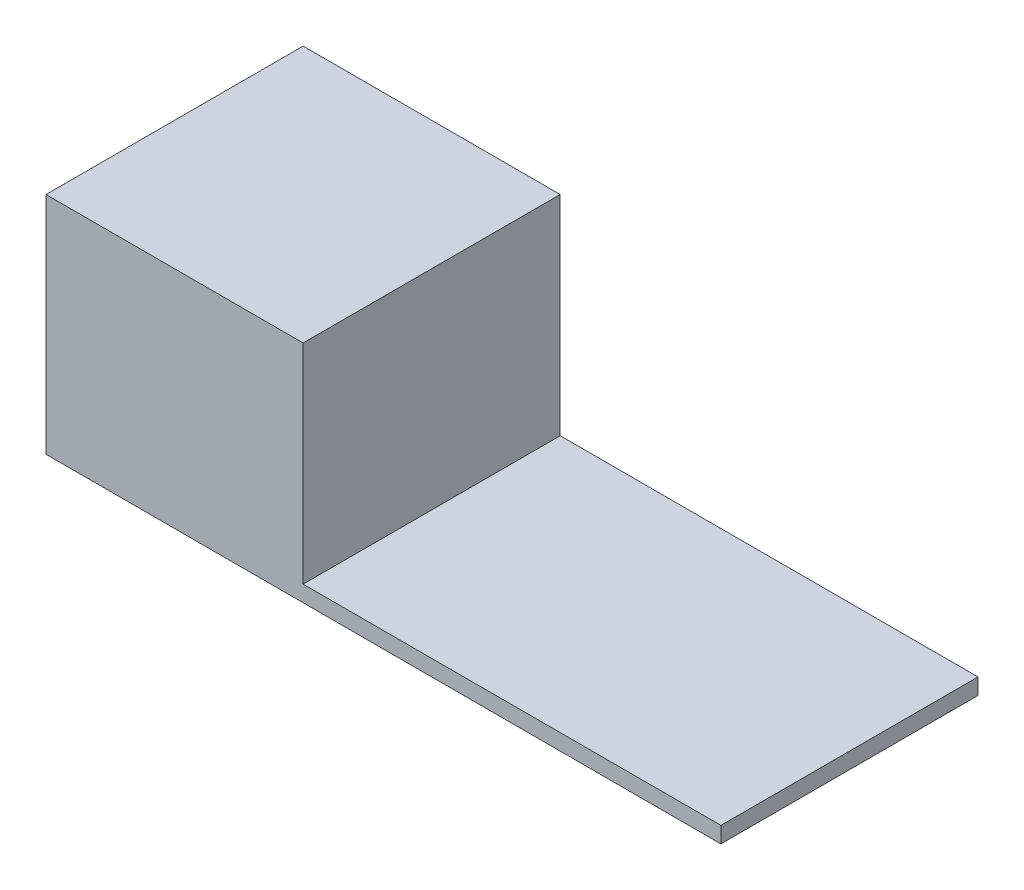
ISO-10303-21;
HEADER;
FILE_DESCRIPTION(('STEP AP214'),'2;1');
FILE_NAME('part.step','',(''),(''),'','','');
FILE_SCHEMA(('AUTOMOTIVE_DESIGN { 1 0 10303 214 1 1 1 1 }'));
ENDSEC;
DATA;
#1=APPLICATION_CONTEXT('core data for automotive mechanical design processes');
#2=APPLICATION_PROTOCOL_DEFINITION('international standard','automotive_design',2000,#1);
#3=PRODUCT_CONTEXT('',#1,'mechanical');
#4=PRODUCT('Part','Part','',(#3));
#5=PRODUCT_RELATED_PRODUCT_CATEGORY('part','',(#4));
#6=PRODUCT_DEFINITION_FORMATION('','',#4);
#7=PRODUCT_DEFINITION_CONTEXT('part definition',#1,'design');
#8=PRODUCT_DEFINITION('design','',#6,#7);
#9=PRODUCT_DEFINITION_SHAPE('','',#8);
#10=(LENGTH_UNIT() NAMED_UNIT(*) SI_UNIT(.MILLI.,.METRE.));
#11=(NAMED_UNIT(*) PLANE_ANGLE_UNIT() SI_UNIT($,.RADIAN.));
#12=(NAMED_UNIT(*) SI_UNIT($,.STERADIAN.) SOLID_ANGLE_UNIT());
#13=UNCERTAINTY_MEASURE_WITH_UNIT(LENGTH_MEASURE(1.E-05),#10,'distance_accuracy_value','');
#14=(GEOMETRIC_REPRESENTATION_CONTEXT(3) GLOBAL_UNCERTAINTY_ASSIGNED_CONTEXT((#13)) GLOBAL_UNIT_ASSIGNED_CONTEXT((#10,
#11,#12)) REPRESENTATION_CONTEXT('',''));
#15=CARTESIAN_POINT('',(0.,0.,0.));
#16=DIRECTION('',(0.,0.,1.));
#17=DIRECTION('',(1.,0.,0.));
#18=AXIS2_PLACEMENT_3D('',#15,#16,#17);
#19=CARTESIAN_POINT('',(0.,0.5,0.));
#20=DIRECTION('',(0.,-1.,0.));
#21=DIRECTION('',(0.,0.,-1.));
#22=AXIS2_PLACEMENT_3D('',#19,#20,#21);
#23=PLANE('',#22);
#24=DIRECTION('',(0.,0.,-1.));
#25=VECTOR('',#24,1.);
#26=CARTESIAN_POINT('',(-9.91329346728701,0.5,5.85626901815152));
#27=LINE('',#26,#25);
#28=CARTESIAN_POINT('',(-9.91329346728701,0.5,5.85626901815152));
#29=VERTEX_POINT('',#28);
#30=CARTESIAN_POINT('',(-9.91329346728701,0.5,-2.14373098184848));
#31=VERTEX_POINT('',#30);
#32=EDGE_CURVE('E49',#29,#31,#27,.T.);
#33=ORIENTED_EDGE('',*,*,#32,.F.);
#34=DIRECTION('',(1.,0.,0.));
#35=VECTOR('',#34,1.);
#36=CARTESIAN_POINT('',(-17.913293467287,0.5,5.85626901815152));
#37=LINE('',#36,#35);
#38=CARTESIAN_POINT('',(3.08670653271299,0.5,5.85626901815152));
#39=VERTEX_POINT('',#38);
#40=EDGE_CURVE('E86',#29,#39,#37,.T.);
#41=ORIENTED_EDGE('',*,*,#40,.T.);
#42=DIRECTION('',(0.,0.,-1.));
#43=VECTOR('',#42,1.);
#44=CARTESIAN_POINT('',(3.08670653271299,0.5,5.85626901815152));
#45=LINE('',#44,#43);
#46=CARTESIAN_POINT('',(3.08670653271299,0.5,-2.14373098184848));
#47=VERTEX_POINT('',#46);
#48=EDGE_CURVE('E55',#39,#47,#45,.T.);
#49=ORIENTED_EDGE('',*,*,#48,.T.);
#50=DIRECTION('',(-1.,0.,0.));
#51=VECTOR('',#50,1.);
#52=CARTESIAN_POINT('',(-17.913293467287,0.5,-2.14373098184848));
#53=LINE('',#52,#51);
#54=EDGE_CURVE('E96',#47,#31,#53,.T.);
#55=ORIENTED_EDGE('',*,*,#54,.T.);
#56=EDGE_LOOP('',(#33,#41,#49,#55));
#57=FACE_BOUND('',#56,.T.);
#58=ADVANCED_FACE('F34',(#57),#23,.F.);
#59=CARTESIAN_POINT('',(-17.913293467287,0.5,5.85626901815152));
#60=DIRECTION('',(1.,0.,0.));
#61=DIRECTION('',(0.,0.,-1.));
#62=AXIS2_PLACEMENT_3D('',#59,#60,#61);
#63=PLANE('',#62);
#64=DIRECTION('',(0.,0.,1.));
#65=VECTOR('',#64,1.);
#66=CARTESIAN_POINT('',(-17.913293467287,0.,5.85626901815152));
#67=LINE('',#66,#65);
#68=CARTESIAN_POINT('',(-17.913293467287,0.,-2.14373098184848));
#69=VERTEX_POINT('',#68);
#70=CARTESIAN_POINT('',(-17.913293467287,0.,5.85626901815152));
#71=VERTEX_POINT('',#70);
#72=EDGE_CURVE('E93',#69,#71,#67,.T.);
#73=ORIENTED_EDGE('',*,*,#72,.T.);
#74=DIRECTION('',(0.,-1.,0.));
#75=VECTOR('',#74,1.);
#76=CARTESIAN_POINT('',(-17.913293467287,0.5,5.85626901815152));
#77=LINE('',#76,#75);
#78=CARTESIAN_POINT('',(-17.913293467287,7.,5.85626901815152));
#79=VERTEX_POINT('',#78);
#80=EDGE_CURVE('E11',#79,#71,#77,.T.);
#81=ORIENTED_EDGE('',*,*,#80,.F.);
#82=DIRECTION('',(0.,0.,1.));
#83=VECTOR('',#82,1.);
#84=CARTESIAN_POINT('',(-17.913293467287,7.,5.85626901815152));
#85=LINE('',#84,#83);
#86=CARTESIAN_POINT('',(-17.913293467287,7.,-2.14373098184848));
#87=VERTEX_POINT('',#86);
#88=EDGE_CURVE('E95',#87,#79,#85,.T.);
#89=ORIENTED_EDGE('',*,*,#88,.F.);
#90=DIRECTION('',(0.,-1.,0.));
#91=VECTOR('',#90,1.);
#92=CARTESIAN_POINT('',(-17.913293467287,0.5,-2.14373098184848));
#93=LINE('',#92,#91);
#94=EDGE_CURVE('E79',#87,#69,#93,.T.);
#95=ORIENTED_EDGE('',*,*,#94,.T.);
#96=EDGE_LOOP('',(#73,#81,#89,#95));
#97=FACE_BOUND('',#96,.T.);
#98=ADVANCED_FACE('F36',(#97),#63,.F.);
#99=CARTESIAN_POINT('',(-17.913293467287,0.5,5.85626901815152));
#100=DIRECTION('',(0.,0.,-1.));
#101=DIRECTION('',(-1.,0.,0.));
#102=AXIS2_PLACEMENT_3D('',#99,#100,#101);
#103=PLANE('',#102);
#104=DIRECTION('',(1.,0.,0.));
#105=VECTOR('',#104,1.);
#106=CARTESIAN_POINT('',(-17.913293467287,0.,5.85626901815152));
#107=LINE('',#106,#105);
#108=CARTESIAN_POINT('',(3.08670653271299,0.,5.85626901815152));
#109=VERTEX_POINT('',#108);
#110=EDGE_CURVE('E99',#71,#109,#107,.T.);
#111=ORIENTED_EDGE('',*,*,#110,.T.);
#112=DIRECTION('',(0.,-1.,0.));
#113=VECTOR('',#112,1.);
#114=CARTESIAN_POINT('',(3.08670653271299,0.5,5.85626901815152));
#115=LINE('',#114,#113);
#116=EDGE_CURVE('E42',#39,#109,#115,.T.);
#117=ORIENTED_EDGE('',*,*,#116,.F.);
#118=ORIENTED_EDGE('',*,*,#40,.F.);
#119=DIRECTION('',(0.,-1.,0.));
#120=VECTOR('',#119,1.);
#121=CARTESIAN_POINT('',(-9.91329346728701,7.,5.85626901815152));
#122=LINE('',#121,#120);
#123=CARTESIAN_POINT('',(-9.91329346728701,7.,5.85626901815152));
#124=VERTEX_POINT('',#123);
#125=EDGE_CURVE('E100',#124,#29,#122,.T.);
#126=ORIENTED_EDGE('',*,*,#125,.F.);
#127=DIRECTION('',(1.,0.,0.));
#128=VECTOR('',#127,1.);
#129=CARTESIAN_POINT('',(-17.913293467287,7.,5.85626901815152));
#130=LINE('',#129,#128);
#131=EDGE_CURVE('E120',#79,#124,#130,.T.);
#132=ORIENTED_EDGE('',*,*,#131,.F.);
#133=ORIENTED_EDGE('',*,*,#80,.T.);
#134=EDGE_LOOP('',(#111,#117,#118,#126,#132,#133));
#135=FACE_BOUND('',#134,.T.);
#136=ADVANCED_FACE('F115',(#135),#103,.F.);
#137=CARTESIAN_POINT('',(3.08670653271299,0.5,5.85626901815152));
#138=DIRECTION('',(-1.,0.,0.));
#139=DIRECTION('',(0.,0.,1.));
#140=AXIS2_PLACEMENT_3D('',#137,#138,#139);
#141=PLANE('',#140);
#142=DIRECTION('',(0.,0.,-1.));
#143=VECTOR('',#142,1.);
#144=CARTESIAN_POINT('',(3.08670653271299,0.,5.85626901815152));
#145=LINE('',#144,#143);
#146=CARTESIAN_POINT('',(3.08670653271299,0.,-2.14373098184848));
#147=VERTEX_POINT('',#146);
#148=EDGE_CURVE('E87',#109,#147,#145,.T.);
#149=ORIENTED_EDGE('',*,*,#148,.T.);
#150=DIRECTION('',(0.,-1.,0.));
#151=VECTOR('',#150,1.);
#152=CARTESIAN_POINT('',(3.08670653271299,0.5,-2.14373098184848));
#153=LINE('',#152,#151);
#154=EDGE_CURVE('E82',#47,#147,#153,.T.);
#155=ORIENTED_EDGE('',*,*,#154,.F.);
#156=ORIENTED_EDGE('',*,*,#48,.F.);
#157=ORIENTED_EDGE('',*,*,#116,.T.);
#158=EDGE_LOOP('',(#149,#155,#156,#157));
#159=FACE_BOUND('',#158,.T.);
#160=ADVANCED_FACE('F113',(#159),#141,.F.);
#161=CARTESIAN_POINT('',(-17.913293467287,0.5,-2.14373098184848));
#162=DIRECTION('',(0.,0.,1.));
#163=DIRECTION('',(1.,0.,0.));
#164=AXIS2_PLACEMENT_3D('',#161,#162,#163);
#165=PLANE('',#164);
#166=DIRECTION('',(-1.,0.,0.));
#167=VECTOR('',#166,1.);
#168=CARTESIAN_POINT('',(-17.913293467287,0.,-2.14373098184848));
#169=LINE('',#168,#167);
#170=EDGE_CURVE('E75',#147,#69,#169,.T.);
#171=ORIENTED_EDGE('',*,*,#170,.T.);
#172=ORIENTED_EDGE('',*,*,#94,.F.);
#173=DIRECTION('',(-1.,0.,0.));
#174=VECTOR('',#173,1.);
#175=CARTESIAN_POINT('',(-17.913293467287,7.,-2.14373098184848));
#176=LINE('',#175,#174);
#177=CARTESIAN_POINT('',(-9.91329346728701,7.,-2.14373098184848));
#178=VERTEX_POINT('',#177);
#179=EDGE_CURVE('E134',#178,#87,#176,.T.);
#180=ORIENTED_EDGE('',*,*,#179,.F.);
#181=DIRECTION('',(0.,-1.,0.));
#182=VECTOR('',#181,1.);
#183=CARTESIAN_POINT('',(-9.91329346728701,7.,-2.14373098184848));
#184=LINE('',#183,#182);
#185=EDGE_CURVE('E104',#178,#31,#184,.T.);
#186=ORIENTED_EDGE('',*,*,#185,.T.);
#187=ORIENTED_EDGE('',*,*,#54,.F.);
#188=ORIENTED_EDGE('',*,*,#154,.T.);
#189=EDGE_LOOP('',(#171,#172,#180,#186,#187,#188));
#190=FACE_BOUND('',#189,.T.);
#191=ADVANCED_FACE('F77',(#190),#165,.F.);
#192=CARTESIAN_POINT('',(0.,0.,0.));
#193=DIRECTION('',(0.,-1.,0.));
#194=DIRECTION('',(0.,0.,-1.));
#195=AXIS2_PLACEMENT_3D('',#192,#193,#194);
#196=PLANE('',#195);
#197=ORIENTED_EDGE('',*,*,#72,.F.);
#198=ORIENTED_EDGE('',*,*,#170,.F.);
#199=ORIENTED_EDGE('',*,*,#148,.F.);
#200=ORIENTED_EDGE('',*,*,#110,.F.);
#201=EDGE_LOOP('',(#197,#198,#199,#200));
#202=FACE_BOUND('',#201,.T.);
#203=ADVANCED_FACE('F98',(#202),#196,.T.);
#204=CARTESIAN_POINT('',(-9.91329346728701,7.,5.85626901815152));
#205=DIRECTION('',(-1.,0.,0.));
#206=DIRECTION('',(0.,0.,1.));
#207=AXIS2_PLACEMENT_3D('',#204,#205,#206);
#208=PLANE('',#207);
#209=ORIENTED_EDGE('',*,*,#32,.T.);
#210=ORIENTED_EDGE('',*,*,#185,.F.);
#211=DIRECTION('',(0.,0.,-1.));
#212=VECTOR('',#211,1.);
#213=CARTESIAN_POINT('',(-9.91329346728701,7.,5.85626901815152));
#214=LINE('',#213,#212);
#215=EDGE_CURVE('E131',#124,#178,#214,.T.);
#216=ORIENTED_EDGE('',*,*,#215,.F.);
#217=ORIENTED_EDGE('',*,*,#125,.T.);
#218=EDGE_LOOP('',(#209,#210,#216,#217));
#219=FACE_BOUND('',#218,.T.);
#220=ADVANCED_FACE('F138',(#219),#208,.F.);
#221=CARTESIAN_POINT('',(0.,7.,0.));
#222=DIRECTION('',(0.,-1.,0.));
#223=DIRECTION('',(0.,0.,-1.));
#224=AXIS2_PLACEMENT_3D('',#221,#222,#223);
#225=PLANE('',#224);
#226=ORIENTED_EDGE('',*,*,#88,.T.);
#227=ORIENTED_EDGE('',*,*,#131,.T.);
#228=ORIENTED_EDGE('',*,*,#215,.T.);
#229=ORIENTED_EDGE('',*,*,#179,.T.);
#230=EDGE_LOOP('',(#226,#227,#228,#229));
#231=FACE_BOUND('',#230,.T.);
#232=ADVANCED_FACE('F133',(#231),#225,.F.);
#233=CLOSED_SHELL('',(#58,#98,#136,#160,#191,#203,#220,#232));
#234=MANIFOLD_SOLID_BREP('B2',#233);
#235=ADVANCED_BREP_SHAPE_REPRESENTATION('',(#18,#234),#14);
#236=SHAPE_DEFINITION_REPRESENTATION(#9,#235);
ENDSEC;
END-ISO-10303-21;
